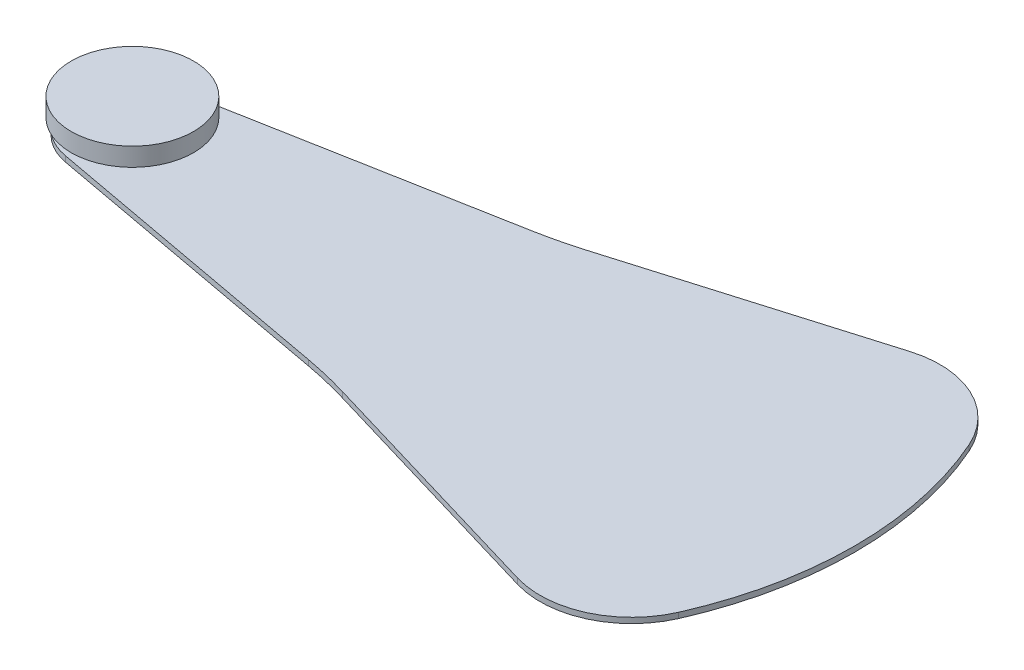
ISO-10303-21;
HEADER;
FILE_DESCRIPTION(('STEP AP214'),'2;1');
FILE_NAME('part.step','',(''),(''),'','','');
FILE_SCHEMA(('AUTOMOTIVE_DESIGN { 1 0 10303 214 1 1 1 1 }'));
ENDSEC;
DATA;
#1=APPLICATION_CONTEXT('core data for automotive mechanical design processes');
#2=APPLICATION_PROTOCOL_DEFINITION('international standard','automotive_design',2000,#1);
#3=PRODUCT_CONTEXT('',#1,'mechanical');
#4=PRODUCT('Part','Part','',(#3));
#5=PRODUCT_RELATED_PRODUCT_CATEGORY('part','',(#4));
#6=PRODUCT_DEFINITION_FORMATION('','',#4);
#7=PRODUCT_DEFINITION_CONTEXT('part definition',#1,'design');
#8=PRODUCT_DEFINITION('design','',#6,#7);
#9=PRODUCT_DEFINITION_SHAPE('','',#8);
#10=(LENGTH_UNIT() NAMED_UNIT(*) SI_UNIT(.MILLI.,.METRE.));
#11=(NAMED_UNIT(*) PLANE_ANGLE_UNIT() SI_UNIT($,.RADIAN.));
#12=(NAMED_UNIT(*) SI_UNIT($,.STERADIAN.) SOLID_ANGLE_UNIT());
#13=UNCERTAINTY_MEASURE_WITH_UNIT(LENGTH_MEASURE(1.E-05),#10,'distance_accuracy_value','');
#14=(GEOMETRIC_REPRESENTATION_CONTEXT(3) GLOBAL_UNCERTAINTY_ASSIGNED_CONTEXT((#13)) GLOBAL_UNIT_ASSIGNED_CONTEXT((#10,
#11,#12)) REPRESENTATION_CONTEXT('',''));
#15=CARTESIAN_POINT('',(0.,0.,0.));
#16=DIRECTION('',(0.,0.,1.));
#17=DIRECTION('',(1.,0.,0.));
#18=AXIS2_PLACEMENT_3D('',#15,#16,#17);
#19=CARTESIAN_POINT('',(63.6753795612186,113.66095277153,78.5378844699252));
#20=DIRECTION('',(0.,1.,0.));
#21=DIRECTION('',(0.,0.,1.));
#22=AXIS2_PLACEMENT_3D('',#19,#20,#21);
#23=PLANE('',#22);
#24=CARTESIAN_POINT('',(60.714349432424,113.66095277153,74.044540046704));
#25=DIRECTION('',(0.,1.,0.));
#26=DIRECTION('',(0.,0.,1.));
#27=AXIS2_PLACEMENT_3D('',#24,#25,#26);
#28=CIRCLE('',#27,1.4);
#29=CARTESIAN_POINT('',(60.714349432424,113.66095277153,75.444540046704));
#30=VERTEX_POINT('',#29);
#31=EDGE_CURVE('E12',#30,#30,#28,.T.);
#32=ORIENTED_EDGE('',*,*,#31,.F.);
#33=EDGE_LOOP('',(#32));
#34=FACE_BOUND('',#33,.T.);
#35=CARTESIAN_POINT('',(60.714349432424,113.66095277153,74.044540046704));
#36=DIRECTION('',(0.,1.,0.));
#37=DIRECTION('',(0.,0.,1.));
#38=AXIS2_PLACEMENT_3D('',#35,#36,#37);
#39=CIRCLE('',#38,1.88124925359555);
#40=CARTESIAN_POINT('',(60.372883835103,113.66095277153,75.894540046704));
#41=VERTEX_POINT('',#40);
#42=CARTESIAN_POINT('',(60.372883835103,113.66095277153,72.194540046704));
#43=VERTEX_POINT('',#42);
#44=EDGE_CURVE('E147',#41,#43,#39,.F.);
#45=ORIENTED_EDGE('',*,*,#44,.F.);
#46=DIRECTION('',(-0.983389094488238,0.,-0.181510024080224));
#47=VECTOR('',#46,1.);
#48=CARTESIAN_POINT('',(70.1254466668456,113.66095277153,77.6946290698131));
#49=LINE('',#48,#47);
#50=CARTESIAN_POINT('',(70.1254466668456,113.66095277153,77.6946290698131));
#51=VERTEX_POINT('',#50);
#52=EDGE_CURVE('E150',#51,#41,#49,.T.);
#53=ORIENTED_EDGE('',*,*,#52,.F.);
#54=CARTESIAN_POINT('',(67.5518945127176,113.66095277153,91.6376778644497));
#55=DIRECTION('',(0.,1.,0.));
#56=DIRECTION('',(0.,0.,1.));
#57=AXIS2_PLACEMENT_3D('',#54,#55,#56);
#58=CIRCLE('',#57,14.1785676420305);
#59=CARTESIAN_POINT('',(71.5840632402642,113.66095277153,78.044540046704));
#60=VERTEX_POINT('',#59);
#61=EDGE_CURVE('E154',#60,#51,#58,.T.);
#62=ORIENTED_EDGE('',*,*,#61,.F.);
#63=DIRECTION('',(-0.958710228066386,0.,-0.284384772097413));
#64=VECTOR('',#63,1.);
#65=CARTESIAN_POINT('',(79.7331001788285,113.66095277153,80.461810609532));
#66=LINE('',#65,#64);
#67=CARTESIAN_POINT('',(79.7331001788285,113.66095277153,80.461810609532));
#68=VERTEX_POINT('',#67);
#69=EDGE_CURVE('E158',#68,#60,#66,.T.);
#70=ORIENTED_EDGE('',*,*,#69,.F.);
#71=CARTESIAN_POINT('',(80.5866071816453,113.66095277153,77.5844909580899));
#72=DIRECTION('',(0.,1.,0.));
#73=DIRECTION('',(0.,0.,1.));
#74=AXIS2_PLACEMENT_3D('',#71,#72,#73);
#75=CIRCLE('',#74,3.0012401737335);
#76=CARTESIAN_POINT('',(83.3331001788285,113.66095277153,78.794540046704));
#77=VERTEX_POINT('',#76);
#78=EDGE_CURVE('E162',#77,#68,#75,.F.);
#79=ORIENTED_EDGE('',*,*,#78,.F.);
#80=CARTESIAN_POINT('',(72.5518501788284,113.66095277153,74.044540046704));
#81=DIRECTION('',(0.,1.,0.));
#82=DIRECTION('',(0.,0.,1.));
#83=AXIS2_PLACEMENT_3D('',#80,#81,#82);
#84=CIRCLE('',#83,11.78125);
#85=CARTESIAN_POINT('',(83.3331001788285,113.66095277153,69.294540046704));
#86=VERTEX_POINT('',#85);
#87=EDGE_CURVE('E166',#86,#77,#84,.F.);
#88=ORIENTED_EDGE('',*,*,#87,.F.);
#89=CARTESIAN_POINT('',(80.5866071816453,113.66095277153,70.504589135318));
#90=DIRECTION('',(0.,1.,0.));
#91=DIRECTION('',(0.,0.,1.));
#92=AXIS2_PLACEMENT_3D('',#89,#90,#91);
#93=CIRCLE('',#92,3.00124017373351);
#94=CARTESIAN_POINT('',(79.7331001788285,113.66095277153,67.627269483876));
#95=VERTEX_POINT('',#94);
#96=EDGE_CURVE('E170',#95,#86,#93,.F.);
#97=ORIENTED_EDGE('',*,*,#96,.F.);
#98=DIRECTION('',(0.958710228066386,0.,-0.284384772097413));
#99=VECTOR('',#98,1.);
#100=CARTESIAN_POINT('',(71.5840632402642,113.66095277153,70.044540046704));
#101=LINE('',#100,#99);
#102=CARTESIAN_POINT('',(71.5840632402642,113.66095277153,70.044540046704));
#103=VERTEX_POINT('',#102);
#104=EDGE_CURVE('E91',#103,#95,#101,.T.);
#105=ORIENTED_EDGE('',*,*,#104,.F.);
#106=CARTESIAN_POINT('',(67.5518945127176,113.66095277153,56.4514022289583));
#107=DIRECTION('',(0.,1.,0.));
#108=DIRECTION('',(0.,0.,1.));
#109=AXIS2_PLACEMENT_3D('',#106,#107,#108);
#110=CIRCLE('',#109,14.1785676420305);
#111=CARTESIAN_POINT('',(70.1254466668456,113.66095277153,70.3944510235948));
#112=VERTEX_POINT('',#111);
#113=EDGE_CURVE('E96',#112,#103,#110,.T.);
#114=ORIENTED_EDGE('',*,*,#113,.F.);
#115=DIRECTION('',(0.983389094488238,0.,-0.181510024080224));
#116=VECTOR('',#115,1.);
#117=CARTESIAN_POINT('',(60.372883835103,113.66095277153,72.194540046704));
#118=LINE('',#117,#116);
#119=EDGE_CURVE('E129',#43,#112,#118,.T.);
#120=ORIENTED_EDGE('',*,*,#119,.F.);
#121=EDGE_LOOP('',(#45,#53,#62,#70,#79,#88,#97,#105,#114,#120));
#122=FACE_BOUND('',#121,.T.);
#123=ADVANCED_FACE('F40',(#34,#122),#23,.T.);
#124=CARTESIAN_POINT('',(60.714349432424,113.48095277153,74.044540046704));
#125=DIRECTION('',(0.,-1.,0.));
#126=DIRECTION('',(0.,0.,-1.));
#127=AXIS2_PLACEMENT_3D('',#124,#125,#126);
#128=PLANE('',#127);
#129=CARTESIAN_POINT('',(60.714349432424,113.48095277153,74.044540046704));
#130=DIRECTION('',(0.,-1.,0.));
#131=DIRECTION('',(0.,0.,-1.));
#132=AXIS2_PLACEMENT_3D('',#129,#130,#131);
#133=CIRCLE('',#132,0.999999999999998);
#134=CARTESIAN_POINT('',(60.714349432424,113.48095277153,73.044540046704));
#135=VERTEX_POINT('',#134);
#136=EDGE_CURVE('E141',#135,#135,#133,.T.);
#137=ORIENTED_EDGE('',*,*,#136,.F.);
#138=EDGE_LOOP('',(#137));
#139=FACE_BOUND('',#138,.T.);
#140=CARTESIAN_POINT('',(60.714349432424,113.48095277153,74.044540046704));
#141=DIRECTION('',(0.,-1.,0.));
#142=DIRECTION('',(0.,0.,-1.));
#143=AXIS2_PLACEMENT_3D('',#140,#141,#142);
#144=CIRCLE('',#143,1.88124925359555);
#145=CARTESIAN_POINT('',(60.372883835103,113.48095277153,75.894540046704));
#146=VERTEX_POINT('',#145);
#147=CARTESIAN_POINT('',(60.372883835103,113.48095277153,72.194540046704));
#148=VERTEX_POINT('',#147);
#149=EDGE_CURVE('E139',#146,#148,#144,.T.);
#150=ORIENTED_EDGE('',*,*,#149,.T.);
#151=DIRECTION('',(0.983389094488238,0.,-0.181510024080224));
#152=VECTOR('',#151,1.);
#153=CARTESIAN_POINT('',(60.372883835103,113.48095277153,72.194540046704));
#154=LINE('',#153,#152);
#155=CARTESIAN_POINT('',(70.1254466668456,113.48095277153,70.3944510235948));
#156=VERTEX_POINT('',#155);
#157=EDGE_CURVE('E127',#148,#156,#154,.T.);
#158=ORIENTED_EDGE('',*,*,#157,.T.);
#159=CARTESIAN_POINT('',(67.5518945127176,113.48095277153,56.4514022289583));
#160=DIRECTION('',(0.,1.,0.));
#161=DIRECTION('',(0.,0.,-1.));
#162=AXIS2_PLACEMENT_3D('',#159,#160,#161);
#163=CIRCLE('',#162,14.1785676420305);
#164=CARTESIAN_POINT('',(71.5840632402642,113.48095277153,70.044540046704));
#165=VERTEX_POINT('',#164);
#166=EDGE_CURVE('E131',#156,#165,#163,.T.);
#167=ORIENTED_EDGE('',*,*,#166,.T.);
#168=DIRECTION('',(0.958710228066386,0.,-0.284384772097413));
#169=VECTOR('',#168,1.);
#170=CARTESIAN_POINT('',(71.5840632402642,113.48095277153,70.044540046704));
#171=LINE('',#170,#169);
#172=CARTESIAN_POINT('',(79.7331001788285,113.48095277153,67.627269483876));
#173=VERTEX_POINT('',#172);
#174=EDGE_CURVE('E135',#165,#173,#171,.T.);
#175=ORIENTED_EDGE('',*,*,#174,.T.);
#176=CARTESIAN_POINT('',(80.5866071816453,113.48095277153,70.504589135318));
#177=DIRECTION('',(0.,-1.,0.));
#178=DIRECTION('',(0.,0.,-1.));
#179=AXIS2_PLACEMENT_3D('',#176,#177,#178);
#180=CIRCLE('',#179,3.00124017373351);
#181=CARTESIAN_POINT('',(83.3331001788285,113.48095277153,69.294540046704));
#182=VERTEX_POINT('',#181);
#183=EDGE_CURVE('E189',#173,#182,#180,.T.);
#184=ORIENTED_EDGE('',*,*,#183,.T.);
#185=CARTESIAN_POINT('',(72.5518501788284,113.48095277153,74.044540046704));
#186=DIRECTION('',(0.,-1.,0.));
#187=DIRECTION('',(0.,0.,-1.));
#188=AXIS2_PLACEMENT_3D('',#185,#186,#187);
#189=CIRCLE('',#188,11.78125);
#190=CARTESIAN_POINT('',(83.3331001788285,113.48095277153,78.794540046704));
#191=VERTEX_POINT('',#190);
#192=EDGE_CURVE('E194',#182,#191,#189,.T.);
#193=ORIENTED_EDGE('',*,*,#192,.T.);
#194=CARTESIAN_POINT('',(80.5866071816453,113.48095277153,77.5844909580899));
#195=DIRECTION('',(0.,-1.,0.));
#196=DIRECTION('',(0.,0.,-1.));
#197=AXIS2_PLACEMENT_3D('',#194,#195,#196);
#198=CIRCLE('',#197,3.0012401737335);
#199=CARTESIAN_POINT('',(79.7331001788285,113.48095277153,80.461810609532));
#200=VERTEX_POINT('',#199);
#201=EDGE_CURVE('E198',#191,#200,#198,.T.);
#202=ORIENTED_EDGE('',*,*,#201,.T.);
#203=DIRECTION('',(-0.958710228066386,0.,-0.284384772097413));
#204=VECTOR('',#203,1.);
#205=CARTESIAN_POINT('',(79.7331001788285,113.48095277153,80.461810609532));
#206=LINE('',#205,#204);
#207=CARTESIAN_POINT('',(71.5840632402642,113.48095277153,78.044540046704));
#208=VERTEX_POINT('',#207);
#209=EDGE_CURVE('E201',#200,#208,#206,.T.);
#210=ORIENTED_EDGE('',*,*,#209,.T.);
#211=CARTESIAN_POINT('',(67.5518945127176,113.48095277153,91.6376778644497));
#212=DIRECTION('',(0.,1.,0.));
#213=DIRECTION('',(0.,0.,-1.));
#214=AXIS2_PLACEMENT_3D('',#211,#212,#213);
#215=CIRCLE('',#214,14.1785676420305);
#216=CARTESIAN_POINT('',(70.1254466668456,113.48095277153,77.6946290698131));
#217=VERTEX_POINT('',#216);
#218=EDGE_CURVE('E204',#208,#217,#215,.T.);
#219=ORIENTED_EDGE('',*,*,#218,.T.);
#220=DIRECTION('',(-0.983389094488238,0.,-0.181510024080224));
#221=VECTOR('',#220,1.);
#222=CARTESIAN_POINT('',(70.1254466668456,113.48095277153,77.6946290698131));
#223=LINE('',#222,#221);
#224=EDGE_CURVE('E146',#217,#146,#223,.T.);
#225=ORIENTED_EDGE('',*,*,#224,.T.);
#226=EDGE_LOOP('',(#150,#158,#167,#175,#184,#193,#202,#210,#219,#225));
#227=FACE_BOUND('',#226,.T.);
#228=ADVANCED_FACE('F137',(#139,#227),#128,.T.);
#229=CARTESIAN_POINT('',(60.372883835103,142.321007259409,72.194540046704));
#230=DIRECTION('',(-0.181510024080224,0.,-0.983389094488238));
#231=DIRECTION('',(-0.983389094488238,0.,0.181510024080224));
#232=AXIS2_PLACEMENT_3D('',#229,#230,#231);
#233=PLANE('',#232);
#234=DIRECTION('',(0.,-1.,0.));
#235=VECTOR('',#234,1.);
#236=CARTESIAN_POINT('',(60.372883835103,142.321007259409,72.194540046704));
#237=LINE('',#236,#235);
#238=EDGE_CURVE('E43',#43,#148,#237,.T.);
#239=ORIENTED_EDGE('',*,*,#238,.F.);
#240=ORIENTED_EDGE('',*,*,#119,.T.);
#241=DIRECTION('',(0.,-1.,0.));
#242=VECTOR('',#241,1.);
#243=CARTESIAN_POINT('',(70.1254466668456,142.321007259409,70.3944510235948));
#244=LINE('',#243,#242);
#245=EDGE_CURVE('E124',#112,#156,#244,.T.);
#246=ORIENTED_EDGE('',*,*,#245,.T.);
#247=ORIENTED_EDGE('',*,*,#157,.F.);
#248=EDGE_LOOP('',(#239,#240,#246,#247));
#249=FACE_BOUND('',#248,.T.);
#250=ADVANCED_FACE('F125',(#249),#233,.T.);
#251=CARTESIAN_POINT('',(67.5518945127176,142.321007259409,56.4514022289583));
#252=DIRECTION('',(0.,-1.,0.));
#253=DIRECTION('',(0.,0.,-1.));
#254=AXIS2_PLACEMENT_3D('',#251,#252,#253);
#255=CYLINDRICAL_SURFACE('',#254,14.1785676420305);
#256=ORIENTED_EDGE('',*,*,#245,.F.);
#257=ORIENTED_EDGE('',*,*,#113,.T.);
#258=DIRECTION('',(0.,-1.,0.));
#259=VECTOR('',#258,1.);
#260=CARTESIAN_POINT('',(71.5840632402642,142.321007259409,70.044540046704));
#261=LINE('',#260,#259);
#262=EDGE_CURVE('E119',#103,#165,#261,.T.);
#263=ORIENTED_EDGE('',*,*,#262,.T.);
#264=ORIENTED_EDGE('',*,*,#166,.F.);
#265=EDGE_LOOP('',(#256,#257,#263,#264));
#266=FACE_BOUND('',#265,.T.);
#267=ADVANCED_FACE('F132',(#266),#255,.F.);
#268=CARTESIAN_POINT('',(71.5840632402642,142.321007259409,70.044540046704));
#269=DIRECTION('',(-0.284384772097413,0.,-0.958710228066386));
#270=DIRECTION('',(-0.958710228066386,0.,0.284384772097413));
#271=AXIS2_PLACEMENT_3D('',#268,#269,#270);
#272=PLANE('',#271);
#273=ORIENTED_EDGE('',*,*,#262,.F.);
#274=ORIENTED_EDGE('',*,*,#104,.T.);
#275=DIRECTION('',(0.,-1.,0.));
#276=VECTOR('',#275,1.);
#277=CARTESIAN_POINT('',(79.7331001788285,142.321007259409,67.627269483876));
#278=LINE('',#277,#276);
#279=EDGE_CURVE('E173',#95,#173,#278,.T.);
#280=ORIENTED_EDGE('',*,*,#279,.T.);
#281=ORIENTED_EDGE('',*,*,#174,.F.);
#282=EDGE_LOOP('',(#273,#274,#280,#281));
#283=FACE_BOUND('',#282,.T.);
#284=ADVANCED_FACE('F186',(#283),#272,.T.);
#285=CARTESIAN_POINT('',(80.5866071816453,142.321007259409,70.504589135318));
#286=DIRECTION('',(0.,-1.,0.));
#287=DIRECTION('',(0.,0.,-1.));
#288=AXIS2_PLACEMENT_3D('',#285,#286,#287);
#289=CYLINDRICAL_SURFACE('',#288,3.00124017373351);
#290=ORIENTED_EDGE('',*,*,#279,.F.);
#291=ORIENTED_EDGE('',*,*,#96,.T.);
#292=DIRECTION('',(0.,-1.,0.));
#293=VECTOR('',#292,1.);
#294=CARTESIAN_POINT('',(83.3331001788285,142.321007259409,69.294540046704));
#295=LINE('',#294,#293);
#296=EDGE_CURVE('E169',#86,#182,#295,.T.);
#297=ORIENTED_EDGE('',*,*,#296,.T.);
#298=ORIENTED_EDGE('',*,*,#183,.F.);
#299=EDGE_LOOP('',(#290,#291,#297,#298));
#300=FACE_BOUND('',#299,.T.);
#301=ADVANCED_FACE('F190',(#300),#289,.T.);
#302=CARTESIAN_POINT('',(72.5518501788284,142.321007259409,74.044540046704));
#303=DIRECTION('',(0.,-1.,0.));
#304=DIRECTION('',(0.,0.,-1.));
#305=AXIS2_PLACEMENT_3D('',#302,#303,#304);
#306=CYLINDRICAL_SURFACE('',#305,11.78125);
#307=ORIENTED_EDGE('',*,*,#296,.F.);
#308=ORIENTED_EDGE('',*,*,#87,.T.);
#309=DIRECTION('',(0.,-1.,0.));
#310=VECTOR('',#309,1.);
#311=CARTESIAN_POINT('',(83.3331001788285,142.321007259409,78.794540046704));
#312=LINE('',#311,#310);
#313=EDGE_CURVE('E165',#77,#191,#312,.T.);
#314=ORIENTED_EDGE('',*,*,#313,.T.);
#315=ORIENTED_EDGE('',*,*,#192,.F.);
#316=EDGE_LOOP('',(#307,#308,#314,#315));
#317=FACE_BOUND('',#316,.T.);
#318=ADVANCED_FACE('F274',(#317),#306,.T.);
#319=CARTESIAN_POINT('',(80.5866071816453,142.321007259409,77.5844909580899));
#320=DIRECTION('',(0.,-1.,0.));
#321=DIRECTION('',(0.,0.,-1.));
#322=AXIS2_PLACEMENT_3D('',#319,#320,#321);
#323=CYLINDRICAL_SURFACE('',#322,3.0012401737335);
#324=ORIENTED_EDGE('',*,*,#313,.F.);
#325=ORIENTED_EDGE('',*,*,#78,.T.);
#326=DIRECTION('',(0.,-1.,0.));
#327=VECTOR('',#326,1.);
#328=CARTESIAN_POINT('',(79.7331001788285,142.321007259409,80.461810609532));
#329=LINE('',#328,#327);
#330=EDGE_CURVE('E161',#68,#200,#329,.T.);
#331=ORIENTED_EDGE('',*,*,#330,.T.);
#332=ORIENTED_EDGE('',*,*,#201,.F.);
#333=EDGE_LOOP('',(#324,#325,#331,#332));
#334=FACE_BOUND('',#333,.T.);
#335=ADVANCED_FACE('F272',(#334),#323,.T.);
#336=CARTESIAN_POINT('',(79.7331001788285,142.321007259409,80.461810609532));
#337=DIRECTION('',(-0.284384772097413,0.,0.958710228066386));
#338=DIRECTION('',(0.958710228066386,0.,0.284384772097413));
#339=AXIS2_PLACEMENT_3D('',#336,#337,#338);
#340=PLANE('',#339);
#341=ORIENTED_EDGE('',*,*,#330,.F.);
#342=ORIENTED_EDGE('',*,*,#69,.T.);
#343=DIRECTION('',(0.,-1.,0.));
#344=VECTOR('',#343,1.);
#345=CARTESIAN_POINT('',(71.5840632402642,142.321007259409,78.044540046704));
#346=LINE('',#345,#344);
#347=EDGE_CURVE('E157',#60,#208,#346,.T.);
#348=ORIENTED_EDGE('',*,*,#347,.T.);
#349=ORIENTED_EDGE('',*,*,#209,.F.);
#350=EDGE_LOOP('',(#341,#342,#348,#349));
#351=FACE_BOUND('',#350,.T.);
#352=ADVANCED_FACE('F269',(#351),#340,.T.);
#353=CARTESIAN_POINT('',(67.5518945127176,142.321007259409,91.6376778644497));
#354=DIRECTION('',(0.,-1.,0.));
#355=DIRECTION('',(0.,0.,-1.));
#356=AXIS2_PLACEMENT_3D('',#353,#354,#355);
#357=CYLINDRICAL_SURFACE('',#356,14.1785676420305);
#358=ORIENTED_EDGE('',*,*,#347,.F.);
#359=ORIENTED_EDGE('',*,*,#61,.T.);
#360=DIRECTION('',(0.,-1.,0.));
#361=VECTOR('',#360,1.);
#362=CARTESIAN_POINT('',(70.1254466668456,142.321007259409,77.6946290698131));
#363=LINE('',#362,#361);
#364=EDGE_CURVE('E153',#51,#217,#363,.T.);
#365=ORIENTED_EDGE('',*,*,#364,.T.);
#366=ORIENTED_EDGE('',*,*,#218,.F.);
#367=EDGE_LOOP('',(#358,#359,#365,#366));
#368=FACE_BOUND('',#367,.T.);
#369=ADVANCED_FACE('F264',(#368),#357,.F.);
#370=CARTESIAN_POINT('',(70.1254466668456,142.321007259409,77.6946290698131));
#371=DIRECTION('',(-0.181510024080224,0.,0.983389094488238));
#372=DIRECTION('',(0.983389094488238,0.,0.181510024080224));
#373=AXIS2_PLACEMENT_3D('',#370,#371,#372);
#374=PLANE('',#373);
#375=ORIENTED_EDGE('',*,*,#364,.F.);
#376=ORIENTED_EDGE('',*,*,#52,.T.);
#377=DIRECTION('',(0.,-1.,0.));
#378=VECTOR('',#377,1.);
#379=CARTESIAN_POINT('',(60.372883835103,142.321007259409,75.894540046704));
#380=LINE('',#379,#378);
#381=EDGE_CURVE('E149',#41,#146,#380,.T.);
#382=ORIENTED_EDGE('',*,*,#381,.T.);
#383=ORIENTED_EDGE('',*,*,#224,.F.);
#384=EDGE_LOOP('',(#375,#376,#382,#383));
#385=FACE_BOUND('',#384,.T.);
#386=ADVANCED_FACE('F260',(#385),#374,.T.);
#387=CARTESIAN_POINT('',(60.714349432424,142.321007259409,74.044540046704));
#388=DIRECTION('',(0.,-1.,0.));
#389=DIRECTION('',(0.,0.,-1.));
#390=AXIS2_PLACEMENT_3D('',#387,#388,#389);
#391=CYLINDRICAL_SURFACE('',#390,1.88124925359555);
#392=ORIENTED_EDGE('',*,*,#381,.F.);
#393=ORIENTED_EDGE('',*,*,#44,.T.);
#394=ORIENTED_EDGE('',*,*,#238,.T.);
#395=ORIENTED_EDGE('',*,*,#149,.F.);
#396=EDGE_LOOP('',(#392,#393,#394,#395));
#397=FACE_BOUND('',#396,.T.);
#398=ADVANCED_FACE('F257',(#397),#391,.T.);
#399=CARTESIAN_POINT('',(60.714349432424,113.66095277153,74.044540046704));
#400=DIRECTION('',(0.,-1.,0.));
#401=DIRECTION('',(0.,0.,-1.));
#402=AXIS2_PLACEMENT_3D('',#399,#400,#401);
#403=CYLINDRICAL_SURFACE('',#402,0.999999999999998);
#404=ORIENTED_EDGE('',*,*,#136,.T.);
#405=EDGE_LOOP('',(#404));
#406=FACE_BOUND('',#405,.T.);
#407=CARTESIAN_POINT('',(60.714349432424,113.99095277153,74.044540046704));
#408=DIRECTION('',(0.,1.,0.));
#409=DIRECTION('',(0.,0.,1.));
#410=AXIS2_PLACEMENT_3D('',#407,#408,#409);
#411=CIRCLE('',#410,0.999999999999998);
#412=CARTESIAN_POINT('',(60.714349432424,113.99095277153,75.044540046704));
#413=VERTEX_POINT('',#412);
#414=EDGE_CURVE('E211',#413,#413,#411,.T.);
#415=ORIENTED_EDGE('',*,*,#414,.T.);
#416=EDGE_LOOP('',(#415));
#417=FACE_BOUND('',#416,.T.);
#418=ADVANCED_FACE('F242',(#406,#417),#403,.F.);
#419=CARTESIAN_POINT('',(60.714349432424,500000.,74.044540046704));
#420=DIRECTION('',(0.,-1.,0.));
#421=DIRECTION('',(0.,0.,-1.));
#422=AXIS2_PLACEMENT_3D('',#419,#420,#421);
#423=CYLINDRICAL_SURFACE('',#422,1.4);
#424=ORIENTED_EDGE('',*,*,#31,.T.);
#425=EDGE_LOOP('',(#424));
#426=FACE_BOUND('',#425,.T.);
#427=CARTESIAN_POINT('',(60.714349432424,113.99095277153,74.044540046704));
#428=DIRECTION('',(0.,1.,0.));
#429=DIRECTION('',(0.,0.,1.));
#430=AXIS2_PLACEMENT_3D('',#427,#428,#429);
#431=CIRCLE('',#430,1.4);
#432=CARTESIAN_POINT('',(60.714349432424,113.99095277153,75.444540046704));
#433=VERTEX_POINT('',#432);
#434=EDGE_CURVE('E210',#433,#433,#431,.T.);
#435=ORIENTED_EDGE('',*,*,#434,.F.);
#436=EDGE_LOOP('',(#435));
#437=FACE_BOUND('',#436,.T.);
#438=ADVANCED_FACE('F234',(#426,#437),#423,.T.);
#439=CARTESIAN_POINT('',(60.714349432424,113.99095277153,74.044540046704));
#440=DIRECTION('',(0.,1.,0.));
#441=DIRECTION('',(0.,0.,1.));
#442=AXIS2_PLACEMENT_3D('',#439,#440,#441);
#443=PLANE('',#442);
#444=ORIENTED_EDGE('',*,*,#434,.T.);
#445=EDGE_LOOP('',(#444));
#446=FACE_BOUND('',#445,.T.);
#447=CARTESIAN_POINT('',(60.714349432424,113.99095277153,74.044540046704));
#448=DIRECTION('',(0.,1.,0.));
#449=DIRECTION('',(0.,0.,1.));
#450=AXIS2_PLACEMENT_3D('',#447,#448,#449);
#451=CIRCLE('',#450,2.);
#452=CARTESIAN_POINT('',(60.714349432424,113.99095277153,76.044540046704));
#453=VERTEX_POINT('',#452);
#454=EDGE_CURVE('E217',#453,#453,#451,.T.);
#455=ORIENTED_EDGE('',*,*,#454,.F.);
#456=EDGE_LOOP('',(#455));
#457=FACE_BOUND('',#456,.T.);
#458=ADVANCED_FACE('F232',(#446,#457),#443,.F.);
#459=CARTESIAN_POINT('',(60.714349432424,114.59095277153,74.044540046704));
#460=DIRECTION('',(0.,1.,0.));
#461=DIRECTION('',(0.,0.,1.));
#462=AXIS2_PLACEMENT_3D('',#459,#460,#461);
#463=PLANE('',#462);
#464=CARTESIAN_POINT('',(60.714349432424,114.59095277153,74.044540046704));
#465=DIRECTION('',(0.,1.,0.));
#466=DIRECTION('',(0.,0.,1.));
#467=AXIS2_PLACEMENT_3D('',#464,#465,#466);
#468=CIRCLE('',#467,2.);
#469=CARTESIAN_POINT('',(60.714349432424,114.59095277153,76.044540046704));
#470=VERTEX_POINT('',#469);
#471=EDGE_CURVE('E214',#470,#470,#468,.T.);
#472=ORIENTED_EDGE('',*,*,#471,.T.);
#473=EDGE_LOOP('',(#472));
#474=FACE_BOUND('',#473,.T.);
#475=ADVANCED_FACE('F223',(#474),#463,.T.);
#476=CARTESIAN_POINT('',(60.714349432424,114.59095277153,74.044540046704));
#477=DIRECTION('',(0.,-1.,0.));
#478=DIRECTION('',(0.,0.,-1.));
#479=AXIS2_PLACEMENT_3D('',#476,#477,#478);
#480=CYLINDRICAL_SURFACE('',#479,2.);
#481=ORIENTED_EDGE('',*,*,#471,.F.);
#482=EDGE_LOOP('',(#481));
#483=FACE_BOUND('',#482,.T.);
#484=ORIENTED_EDGE('',*,*,#454,.T.);
#485=EDGE_LOOP('',(#484));
#486=FACE_BOUND('',#485,.T.);
#487=ADVANCED_FACE('F225',(#483,#486),#480,.T.);
#488=ORIENTED_EDGE('',*,*,#414,.F.);
#489=EDGE_LOOP('',(#488));
#490=FACE_BOUND('',#489,.T.);
#491=ADVANCED_FACE('F228',(#490),#443,.F.);
#492=CLOSED_SHELL('',(#123,#228,#250,#267,#284,#301,#318,#335,#352,#369,#386,#398,#418,#438,
#458,#475,#487,#491));
#493=MANIFOLD_SOLID_BREP('B2',#492);
#494=ADVANCED_BREP_SHAPE_REPRESENTATION('',(#18,#493),#14);
#495=SHAPE_DEFINITION_REPRESENTATION(#9,#494);
ENDSEC;
END-ISO-10303-21;
